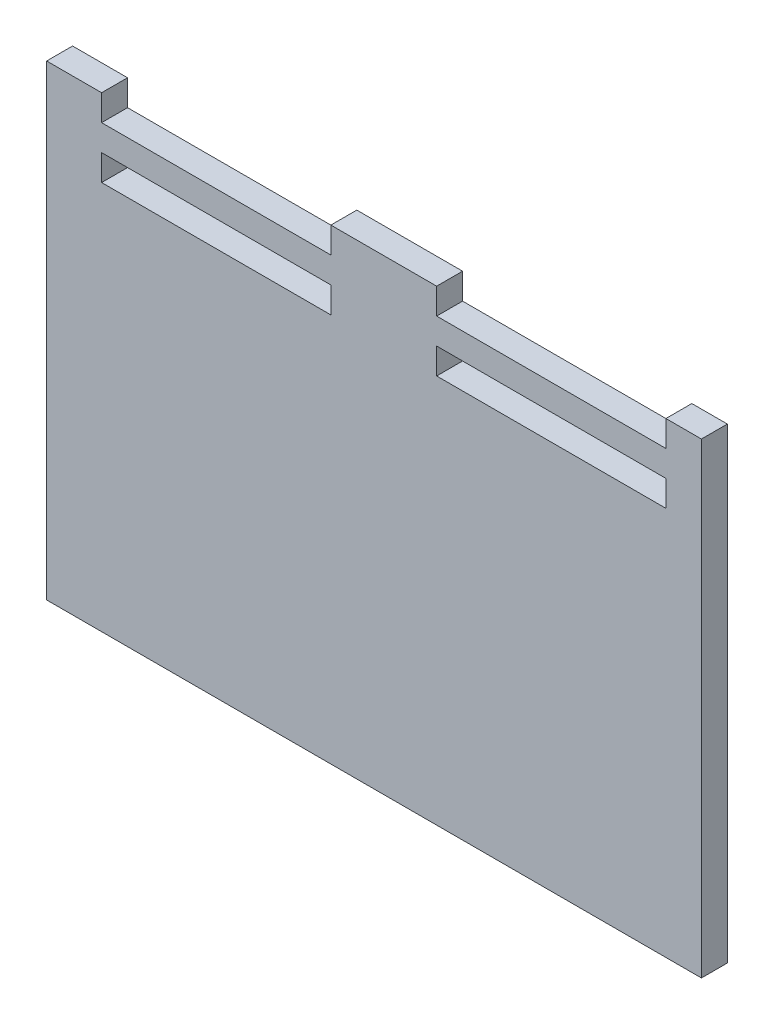
ISO-10303-21;
HEADER;
FILE_DESCRIPTION(('STEP AP214'),'2;1');
FILE_NAME('part.step','',(''),(''),'','','');
FILE_SCHEMA(('AUTOMOTIVE_DESIGN { 1 0 10303 214 1 1 1 1 }'));
ENDSEC;
DATA;
#1=APPLICATION_CONTEXT('core data for automotive mechanical design processes');
#2=APPLICATION_PROTOCOL_DEFINITION('international standard','automotive_design',2000,#1);
#3=PRODUCT_CONTEXT('',#1,'mechanical');
#4=PRODUCT('Part','Part','',(#3));
#5=PRODUCT_RELATED_PRODUCT_CATEGORY('part','',(#4));
#6=PRODUCT_DEFINITION_FORMATION('','',#4);
#7=PRODUCT_DEFINITION_CONTEXT('part definition',#1,'design');
#8=PRODUCT_DEFINITION('design','',#6,#7);
#9=PRODUCT_DEFINITION_SHAPE('','',#8);
#10=(LENGTH_UNIT() NAMED_UNIT(*) SI_UNIT(.MILLI.,.METRE.));
#11=(NAMED_UNIT(*) PLANE_ANGLE_UNIT() SI_UNIT($,.RADIAN.));
#12=(NAMED_UNIT(*) SI_UNIT($,.STERADIAN.) SOLID_ANGLE_UNIT());
#13=UNCERTAINTY_MEASURE_WITH_UNIT(LENGTH_MEASURE(1.E-05),#10,'distance_accuracy_value','');
#14=(GEOMETRIC_REPRESENTATION_CONTEXT(3) GLOBAL_UNCERTAINTY_ASSIGNED_CONTEXT((#13)) GLOBAL_UNIT_ASSIGNED_CONTEXT((#10,
#11,#12)) REPRESENTATION_CONTEXT('',''));
#15=CARTESIAN_POINT('',(0.,0.,0.));
#16=DIRECTION('',(0.,0.,1.));
#17=DIRECTION('',(1.,0.,0.));
#18=AXIS2_PLACEMENT_3D('',#15,#16,#17);
#19=CARTESIAN_POINT('',(0.,228.6,12.7));
#20=DIRECTION('',(0.,-1.,0.));
#21=DIRECTION('',(0.,0.,-1.));
#22=AXIS2_PLACEMENT_3D('',#19,#20,#21);
#23=PLANE('',#22);
#24=DIRECTION('',(0.,0.,1.));
#25=VECTOR('',#24,1.);
#26=CARTESIAN_POINT('',(290.576,228.6,0.));
#27=LINE('',#26,#25);
#28=CARTESIAN_POINT('',(290.576,228.6,0.));
#29=VERTEX_POINT('',#28);
#30=CARTESIAN_POINT('',(290.576,228.6,12.7));
#31=VERTEX_POINT('',#30);
#32=EDGE_CURVE('E258',#29,#31,#27,.T.);
#33=ORIENTED_EDGE('',*,*,#32,.T.);
#34=DIRECTION('',(-1.,0.,0.));
#35=VECTOR('',#34,1.);
#36=CARTESIAN_POINT('',(0.,228.6,12.7));
#37=LINE('',#36,#35);
#38=CARTESIAN_POINT('',(307.975,228.6,12.7));
#39=VERTEX_POINT('',#38);
#40=EDGE_CURVE('E11',#39,#31,#37,.T.);
#41=ORIENTED_EDGE('',*,*,#40,.F.);
#42=DIRECTION('',(0.,0.,1.));
#43=VECTOR('',#42,1.);
#44=CARTESIAN_POINT('',(307.975,228.6,0.));
#45=LINE('',#44,#43);
#46=CARTESIAN_POINT('',(307.975,228.6,0.));
#47=VERTEX_POINT('',#46);
#48=EDGE_CURVE('E199',#47,#39,#45,.T.);
#49=ORIENTED_EDGE('',*,*,#48,.F.);
#50=DIRECTION('',(-1.,0.,0.));
#51=VECTOR('',#50,1.);
#52=CARTESIAN_POINT('',(0.,228.6,0.));
#53=LINE('',#52,#51);
#54=EDGE_CURVE('E44',#47,#29,#53,.T.);
#55=ORIENTED_EDGE('',*,*,#54,.T.);
#56=EDGE_LOOP('',(#33,#41,#49,#55));
#57=FACE_BOUND('',#56,.T.);
#58=ADVANCED_FACE('F40',(#57),#23,.F.);
#59=CARTESIAN_POINT('',(178.308,228.6,12.7));
#60=VERTEX_POINT('',#59);
#61=CARTESIAN_POINT('',(126.492,228.6,12.7));
#62=VERTEX_POINT('',#61);
#63=EDGE_CURVE('E49',#60,#62,#37,.T.);
#64=ORIENTED_EDGE('',*,*,#63,.F.);
#65=DIRECTION('',(0.,0.,1.));
#66=VECTOR('',#65,1.);
#67=CARTESIAN_POINT('',(178.308,228.6,0.));
#68=LINE('',#67,#66);
#69=CARTESIAN_POINT('',(178.308,228.6,0.));
#70=VERTEX_POINT('',#69);
#71=EDGE_CURVE('E260',#70,#60,#68,.T.);
#72=ORIENTED_EDGE('',*,*,#71,.F.);
#73=CARTESIAN_POINT('',(126.492,228.6,0.));
#74=VERTEX_POINT('',#73);
#75=EDGE_CURVE('E196',#70,#74,#53,.T.);
#76=ORIENTED_EDGE('',*,*,#75,.T.);
#77=DIRECTION('',(0.,0.,1.));
#78=VECTOR('',#77,1.);
#79=CARTESIAN_POINT('',(126.492,228.6,0.));
#80=LINE('',#79,#78);
#81=EDGE_CURVE('E314',#74,#62,#80,.T.);
#82=ORIENTED_EDGE('',*,*,#81,.T.);
#83=EDGE_LOOP('',(#64,#72,#76,#82));
#84=FACE_BOUND('',#83,.T.);
#85=ADVANCED_FACE('F342',(#84),#23,.F.);
#86=CARTESIAN_POINT('',(0.,0.,12.7));
#87=DIRECTION('',(0.,0.,-1.));
#88=DIRECTION('',(-1.,0.,0.));
#89=AXIS2_PLACEMENT_3D('',#86,#87,#88);
#90=PLANE('',#89);
#91=DIRECTION('',(1.,0.,0.));
#92=VECTOR('',#91,1.);
#93=CARTESIAN_POINT('',(178.308,215.9,12.7));
#94=LINE('',#93,#92);
#95=CARTESIAN_POINT('',(178.308,215.9,12.7));
#96=VERTEX_POINT('',#95);
#97=CARTESIAN_POINT('',(290.576,215.9,12.7));
#98=VERTEX_POINT('',#97);
#99=EDGE_CURVE('E265',#96,#98,#94,.T.);
#100=ORIENTED_EDGE('',*,*,#99,.F.);
#101=DIRECTION('',(0.,-1.,0.));
#102=VECTOR('',#101,1.);
#103=CARTESIAN_POINT('',(178.308,228.6,12.7));
#104=LINE('',#103,#102);
#105=EDGE_CURVE('E269',#60,#96,#104,.T.);
#106=ORIENTED_EDGE('',*,*,#105,.F.);
#107=ORIENTED_EDGE('',*,*,#63,.T.);
#108=DIRECTION('',(0.,-1.,0.));
#109=VECTOR('',#108,1.);
#110=CARTESIAN_POINT('',(126.492,0.,12.7));
#111=LINE('',#110,#109);
#112=CARTESIAN_POINT('',(126.492,215.9,12.7));
#113=VERTEX_POINT('',#112);
#114=EDGE_CURVE('E272',#62,#113,#111,.T.);
#115=ORIENTED_EDGE('',*,*,#114,.T.);
#116=DIRECTION('',(1.,0.,0.));
#117=VECTOR('',#116,1.);
#118=CARTESIAN_POINT('',(0.,215.9,12.7));
#119=LINE('',#118,#117);
#120=CARTESIAN_POINT('',(14.224,215.9,12.7));
#121=VERTEX_POINT('',#120);
#122=EDGE_CURVE('E308',#121,#113,#119,.T.);
#123=ORIENTED_EDGE('',*,*,#122,.F.);
#124=DIRECTION('',(0.,-1.,0.));
#125=VECTOR('',#124,1.);
#126=CARTESIAN_POINT('',(14.224,0.,12.7));
#127=LINE('',#126,#125);
#128=CARTESIAN_POINT('',(14.224,228.6,12.7));
#129=VERTEX_POINT('',#128);
#130=EDGE_CURVE('E317',#129,#121,#127,.T.);
#131=ORIENTED_EDGE('',*,*,#130,.F.);
#132=CARTESIAN_POINT('',(-12.7,228.6,12.7));
#133=VERTEX_POINT('',#132);
#134=EDGE_CURVE('E51',#129,#133,#37,.T.);
#135=ORIENTED_EDGE('',*,*,#134,.T.);
#136=DIRECTION('',(0.,-1.,0.));
#137=VECTOR('',#136,1.);
#138=CARTESIAN_POINT('',(-12.7,0.,12.7));
#139=LINE('',#138,#137);
#140=CARTESIAN_POINT('',(-12.7,0.,12.7));
#141=VERTEX_POINT('',#140);
#142=EDGE_CURVE('E211',#133,#141,#139,.T.);
#143=ORIENTED_EDGE('',*,*,#142,.T.);
#144=DIRECTION('',(1.,0.,0.));
#145=VECTOR('',#144,1.);
#146=CARTESIAN_POINT('',(0.,0.,12.7));
#147=LINE('',#146,#145);
#148=CARTESIAN_POINT('',(307.975,0.,12.7));
#149=VERTEX_POINT('',#148);
#150=EDGE_CURVE('E195',#141,#149,#147,.T.);
#151=ORIENTED_EDGE('',*,*,#150,.T.);
#152=DIRECTION('',(0.,-1.,0.));
#153=VECTOR('',#152,1.);
#154=CARTESIAN_POINT('',(307.975,0.,12.7));
#155=LINE('',#154,#153);
#156=EDGE_CURVE('E207',#39,#149,#155,.T.);
#157=ORIENTED_EDGE('',*,*,#156,.F.);
#158=ORIENTED_EDGE('',*,*,#40,.T.);
#159=DIRECTION('',(0.,-1.,0.));
#160=VECTOR('',#159,1.);
#161=CARTESIAN_POINT('',(290.576,228.6,12.7));
#162=LINE('',#161,#160);
#163=EDGE_CURVE('E262',#31,#98,#162,.T.);
#164=ORIENTED_EDGE('',*,*,#163,.T.);
#165=EDGE_LOOP('',(#100,#106,#107,#115,#123,#131,#135,#143,#151,#157,#158,#164));
#166=FACE_BOUND('',#165,.T.);
#167=DIRECTION('',(0.,-1.,0.));
#168=VECTOR('',#167,1.);
#169=CARTESIAN_POINT('',(126.492,203.2,12.7));
#170=LINE('',#169,#168);
#171=CARTESIAN_POINT('',(126.492,203.2,12.7));
#172=VERTEX_POINT('',#171);
#173=CARTESIAN_POINT('',(126.492,190.5,12.7));
#174=VERTEX_POINT('',#173);
#175=EDGE_CURVE('E292',#172,#174,#170,.T.);
#176=ORIENTED_EDGE('',*,*,#175,.T.);
#177=DIRECTION('',(1.,0.,0.));
#178=VECTOR('',#177,1.);
#179=CARTESIAN_POINT('',(14.224,190.5,12.7));
#180=LINE('',#179,#178);
#181=CARTESIAN_POINT('',(14.224,190.5,12.7));
#182=VERTEX_POINT('',#181);
#183=EDGE_CURVE('E58',#182,#174,#180,.T.);
#184=ORIENTED_EDGE('',*,*,#183,.F.);
#185=DIRECTION('',(0.,-1.,0.));
#186=VECTOR('',#185,1.);
#187=CARTESIAN_POINT('',(14.224,203.2,12.7));
#188=LINE('',#187,#186);
#189=CARTESIAN_POINT('',(14.224,203.2,12.7));
#190=VERTEX_POINT('',#189);
#191=EDGE_CURVE('E285',#190,#182,#188,.T.);
#192=ORIENTED_EDGE('',*,*,#191,.F.);
#193=DIRECTION('',(1.,0.,0.));
#194=VECTOR('',#193,1.);
#195=CARTESIAN_POINT('',(14.224,203.2,12.7));
#196=LINE('',#195,#194);
#197=EDGE_CURVE('E288',#190,#172,#196,.T.);
#198=ORIENTED_EDGE('',*,*,#197,.T.);
#199=EDGE_LOOP('',(#176,#184,#192,#198));
#200=FACE_BOUND('',#199,.T.);
#201=DIRECTION('',(0.,-1.,0.));
#202=VECTOR('',#201,1.);
#203=CARTESIAN_POINT('',(290.576,203.2,12.7));
#204=LINE('',#203,#202);
#205=CARTESIAN_POINT('',(290.576,203.2,12.7));
#206=VERTEX_POINT('',#205);
#207=CARTESIAN_POINT('',(290.576,190.5,12.7));
#208=VERTEX_POINT('',#207);
#209=EDGE_CURVE('E240',#206,#208,#204,.T.);
#210=ORIENTED_EDGE('',*,*,#209,.T.);
#211=DIRECTION('',(1.,0.,0.));
#212=VECTOR('',#211,1.);
#213=CARTESIAN_POINT('',(178.308,190.5,12.7));
#214=LINE('',#213,#212);
#215=CARTESIAN_POINT('',(178.308,190.5,12.7));
#216=VERTEX_POINT('',#215);
#217=EDGE_CURVE('E66',#216,#208,#214,.T.);
#218=ORIENTED_EDGE('',*,*,#217,.F.);
#219=DIRECTION('',(0.,-1.,0.));
#220=VECTOR('',#219,1.);
#221=CARTESIAN_POINT('',(178.308,203.2,12.7));
#222=LINE('',#221,#220);
#223=CARTESIAN_POINT('',(178.308,203.2,12.7));
#224=VERTEX_POINT('',#223);
#225=EDGE_CURVE('E233',#224,#216,#222,.T.);
#226=ORIENTED_EDGE('',*,*,#225,.F.);
#227=DIRECTION('',(1.,0.,0.));
#228=VECTOR('',#227,1.);
#229=CARTESIAN_POINT('',(178.308,203.2,12.7));
#230=LINE('',#229,#228);
#231=EDGE_CURVE('E236',#224,#206,#230,.T.);
#232=ORIENTED_EDGE('',*,*,#231,.T.);
#233=EDGE_LOOP('',(#210,#218,#226,#232));
#234=FACE_BOUND('',#233,.T.);
#235=ADVANCED_FACE('F355',(#166,#200,#234),#90,.F.);
#236=CARTESIAN_POINT('',(0.,0.,0.));
#237=DIRECTION('',(0.,0.,-1.));
#238=DIRECTION('',(-1.,0.,0.));
#239=AXIS2_PLACEMENT_3D('',#236,#237,#238);
#240=PLANE('',#239);
#241=DIRECTION('',(0.,-1.,0.));
#242=VECTOR('',#241,1.);
#243=CARTESIAN_POINT('',(178.308,228.6,0.));
#244=LINE('',#243,#242);
#245=CARTESIAN_POINT('',(178.308,215.9,0.));
#246=VERTEX_POINT('',#245);
#247=EDGE_CURVE('E266',#70,#246,#244,.T.);
#248=ORIENTED_EDGE('',*,*,#247,.T.);
#249=DIRECTION('',(1.,0.,0.));
#250=VECTOR('',#249,1.);
#251=CARTESIAN_POINT('',(178.308,215.9,0.));
#252=LINE('',#251,#250);
#253=CARTESIAN_POINT('',(290.576,215.9,0.));
#254=VERTEX_POINT('',#253);
#255=EDGE_CURVE('E274',#246,#254,#252,.T.);
#256=ORIENTED_EDGE('',*,*,#255,.T.);
#257=DIRECTION('',(0.,-1.,0.));
#258=VECTOR('',#257,1.);
#259=CARTESIAN_POINT('',(290.576,228.6,0.));
#260=LINE('',#259,#258);
#261=EDGE_CURVE('E192',#29,#254,#260,.T.);
#262=ORIENTED_EDGE('',*,*,#261,.F.);
#263=ORIENTED_EDGE('',*,*,#54,.F.);
#264=DIRECTION('',(0.,-1.,0.));
#265=VECTOR('',#264,1.);
#266=CARTESIAN_POINT('',(307.975,0.,0.));
#267=LINE('',#266,#265);
#268=CARTESIAN_POINT('',(307.975,0.,0.));
#269=VERTEX_POINT('',#268);
#270=EDGE_CURVE('E188',#47,#269,#267,.T.);
#271=ORIENTED_EDGE('',*,*,#270,.T.);
#272=DIRECTION('',(1.,0.,0.));
#273=VECTOR('',#272,1.);
#274=CARTESIAN_POINT('',(0.,0.,0.));
#275=LINE('',#274,#273);
#276=CARTESIAN_POINT('',(-12.7,0.,0.));
#277=VERTEX_POINT('',#276);
#278=EDGE_CURVE('E324',#277,#269,#275,.T.);
#279=ORIENTED_EDGE('',*,*,#278,.F.);
#280=DIRECTION('',(0.,-1.,0.));
#281=VECTOR('',#280,1.);
#282=CARTESIAN_POINT('',(-12.7,0.,0.));
#283=LINE('',#282,#281);
#284=CARTESIAN_POINT('',(-12.7,228.6,0.));
#285=VERTEX_POINT('',#284);
#286=EDGE_CURVE('E213',#285,#277,#283,.T.);
#287=ORIENTED_EDGE('',*,*,#286,.F.);
#288=CARTESIAN_POINT('',(14.224,228.6,0.));
#289=VERTEX_POINT('',#288);
#290=EDGE_CURVE('E197',#289,#285,#53,.T.);
#291=ORIENTED_EDGE('',*,*,#290,.F.);
#292=DIRECTION('',(0.,-1.,0.));
#293=VECTOR('',#292,1.);
#294=CARTESIAN_POINT('',(14.224,0.,0.));
#295=LINE('',#294,#293);
#296=CARTESIAN_POINT('',(14.224,215.9,0.));
#297=VERTEX_POINT('',#296);
#298=EDGE_CURVE('E307',#289,#297,#295,.T.);
#299=ORIENTED_EDGE('',*,*,#298,.T.);
#300=DIRECTION('',(1.,0.,0.));
#301=VECTOR('',#300,1.);
#302=CARTESIAN_POINT('',(0.,215.9,0.));
#303=LINE('',#302,#301);
#304=CARTESIAN_POINT('',(126.492,215.9,0.));
#305=VERTEX_POINT('',#304);
#306=EDGE_CURVE('E311',#297,#305,#303,.T.);
#307=ORIENTED_EDGE('',*,*,#306,.T.);
#308=DIRECTION('',(0.,-1.,0.));
#309=VECTOR('',#308,1.);
#310=CARTESIAN_POINT('',(126.492,0.,0.));
#311=LINE('',#310,#309);
#312=EDGE_CURVE('E305',#74,#305,#311,.T.);
#313=ORIENTED_EDGE('',*,*,#312,.F.);
#314=ORIENTED_EDGE('',*,*,#75,.F.);
#315=EDGE_LOOP('',(#248,#256,#262,#263,#271,#279,#287,#291,#299,#307,#313,#314));
#316=FACE_BOUND('',#315,.T.);
#317=DIRECTION('',(1.,0.,0.));
#318=VECTOR('',#317,1.);
#319=CARTESIAN_POINT('',(14.224,190.5,0.));
#320=LINE('',#319,#318);
#321=CARTESIAN_POINT('',(14.224,190.5,0.));
#322=VERTEX_POINT('',#321);
#323=CARTESIAN_POINT('',(126.492,190.5,0.));
#324=VERTEX_POINT('',#323);
#325=EDGE_CURVE('E289',#322,#324,#320,.T.);
#326=ORIENTED_EDGE('',*,*,#325,.T.);
#327=DIRECTION('',(0.,-1.,0.));
#328=VECTOR('',#327,1.);
#329=CARTESIAN_POINT('',(126.492,203.2,0.));
#330=LINE('',#329,#328);
#331=CARTESIAN_POINT('',(126.492,203.2,0.));
#332=VERTEX_POINT('',#331);
#333=EDGE_CURVE('E301',#332,#324,#330,.T.);
#334=ORIENTED_EDGE('',*,*,#333,.F.);
#335=DIRECTION('',(1.,0.,0.));
#336=VECTOR('',#335,1.);
#337=CARTESIAN_POINT('',(14.224,203.2,0.));
#338=LINE('',#337,#336);
#339=CARTESIAN_POINT('',(14.224,203.2,0.));
#340=VERTEX_POINT('',#339);
#341=EDGE_CURVE('E298',#340,#332,#338,.T.);
#342=ORIENTED_EDGE('',*,*,#341,.F.);
#343=DIRECTION('',(0.,-1.,0.));
#344=VECTOR('',#343,1.);
#345=CARTESIAN_POINT('',(14.224,203.2,0.));
#346=LINE('',#345,#344);
#347=EDGE_CURVE('E279',#340,#322,#346,.T.);
#348=ORIENTED_EDGE('',*,*,#347,.T.);
#349=EDGE_LOOP('',(#326,#334,#342,#348));
#350=FACE_BOUND('',#349,.T.);
#351=DIRECTION('',(1.,0.,0.));
#352=VECTOR('',#351,1.);
#353=CARTESIAN_POINT('',(178.308,190.5,0.));
#354=LINE('',#353,#352);
#355=CARTESIAN_POINT('',(178.308,190.5,0.));
#356=VERTEX_POINT('',#355);
#357=CARTESIAN_POINT('',(290.576,190.5,0.));
#358=VERTEX_POINT('',#357);
#359=EDGE_CURVE('E237',#356,#358,#354,.T.);
#360=ORIENTED_EDGE('',*,*,#359,.T.);
#361=DIRECTION('',(0.,-1.,0.));
#362=VECTOR('',#361,1.);
#363=CARTESIAN_POINT('',(290.576,203.2,0.));
#364=LINE('',#363,#362);
#365=CARTESIAN_POINT('',(290.576,203.2,0.));
#366=VERTEX_POINT('',#365);
#367=EDGE_CURVE('E250',#366,#358,#364,.T.);
#368=ORIENTED_EDGE('',*,*,#367,.F.);
#369=DIRECTION('',(1.,0.,0.));
#370=VECTOR('',#369,1.);
#371=CARTESIAN_POINT('',(178.308,203.2,0.));
#372=LINE('',#371,#370);
#373=CARTESIAN_POINT('',(178.308,203.2,0.));
#374=VERTEX_POINT('',#373);
#375=EDGE_CURVE('E247',#374,#366,#372,.T.);
#376=ORIENTED_EDGE('',*,*,#375,.F.);
#377=DIRECTION('',(0.,-1.,0.));
#378=VECTOR('',#377,1.);
#379=CARTESIAN_POINT('',(178.308,203.2,0.));
#380=LINE('',#379,#378);
#381=EDGE_CURVE('E227',#374,#356,#380,.T.);
#382=ORIENTED_EDGE('',*,*,#381,.T.);
#383=EDGE_LOOP('',(#360,#368,#376,#382));
#384=FACE_BOUND('',#383,.T.);
#385=ADVANCED_FACE('F185',(#316,#350,#384),#240,.T.);
#386=CARTESIAN_POINT('',(0.,0.,12.7));
#387=DIRECTION('',(0.,1.,0.));
#388=DIRECTION('',(0.,0.,1.));
#389=AXIS2_PLACEMENT_3D('',#386,#387,#388);
#390=PLANE('',#389);
#391=ORIENTED_EDGE('',*,*,#278,.T.);
#392=DIRECTION('',(0.,0.,1.));
#393=VECTOR('',#392,1.);
#394=CARTESIAN_POINT('',(307.975,0.,0.));
#395=LINE('',#394,#393);
#396=EDGE_CURVE('E203',#269,#149,#395,.T.);
#397=ORIENTED_EDGE('',*,*,#396,.T.);
#398=ORIENTED_EDGE('',*,*,#150,.F.);
#399=DIRECTION('',(0.,0.,1.));
#400=VECTOR('',#399,1.);
#401=CARTESIAN_POINT('',(-12.7,0.,0.));
#402=LINE('',#401,#400);
#403=EDGE_CURVE('E219',#277,#141,#402,.T.);
#404=ORIENTED_EDGE('',*,*,#403,.F.);
#405=EDGE_LOOP('',(#391,#397,#398,#404));
#406=FACE_BOUND('',#405,.T.);
#407=ADVANCED_FACE('F42',(#406),#390,.F.);
#408=ORIENTED_EDGE('',*,*,#134,.F.);
#409=DIRECTION('',(0.,0.,1.));
#410=VECTOR('',#409,1.);
#411=CARTESIAN_POINT('',(14.224,228.6,0.));
#412=LINE('',#411,#410);
#413=EDGE_CURVE('E327',#289,#129,#412,.T.);
#414=ORIENTED_EDGE('',*,*,#413,.F.);
#415=ORIENTED_EDGE('',*,*,#290,.T.);
#416=DIRECTION('',(0.,0.,1.));
#417=VECTOR('',#416,1.);
#418=CARTESIAN_POINT('',(-12.7,228.6,0.));
#419=LINE('',#418,#417);
#420=EDGE_CURVE('E216',#285,#133,#419,.T.);
#421=ORIENTED_EDGE('',*,*,#420,.T.);
#422=EDGE_LOOP('',(#408,#414,#415,#421));
#423=FACE_BOUND('',#422,.T.);
#424=ADVANCED_FACE('F360',(#423),#23,.F.);
#425=CARTESIAN_POINT('',(126.492,0.,0.));
#426=DIRECTION('',(-1.,0.,0.));
#427=DIRECTION('',(0.,0.,1.));
#428=AXIS2_PLACEMENT_3D('',#425,#426,#427);
#429=PLANE('',#428);
#430=ORIENTED_EDGE('',*,*,#114,.F.);
#431=ORIENTED_EDGE('',*,*,#81,.F.);
#432=ORIENTED_EDGE('',*,*,#312,.T.);
#433=DIRECTION('',(0.,0.,1.));
#434=VECTOR('',#433,1.);
#435=CARTESIAN_POINT('',(126.492,215.9,0.));
#436=LINE('',#435,#434);
#437=EDGE_CURVE('E322',#305,#113,#436,.T.);
#438=ORIENTED_EDGE('',*,*,#437,.T.);
#439=EDGE_LOOP('',(#430,#431,#432,#438));
#440=FACE_BOUND('',#439,.T.);
#441=ADVANCED_FACE('F347',(#440),#429,.T.);
#442=CARTESIAN_POINT('',(0.,215.9,0.));
#443=DIRECTION('',(0.,-1.,0.));
#444=DIRECTION('',(0.,0.,-1.));
#445=AXIS2_PLACEMENT_3D('',#442,#443,#444);
#446=PLANE('',#445);
#447=ORIENTED_EDGE('',*,*,#122,.T.);
#448=ORIENTED_EDGE('',*,*,#437,.F.);
#449=ORIENTED_EDGE('',*,*,#306,.F.);
#450=DIRECTION('',(0.,0.,1.));
#451=VECTOR('',#450,1.);
#452=CARTESIAN_POINT('',(14.224,215.9,0.));
#453=LINE('',#452,#451);
#454=EDGE_CURVE('E325',#297,#121,#453,.T.);
#455=ORIENTED_EDGE('',*,*,#454,.T.);
#456=EDGE_LOOP('',(#447,#448,#449,#455));
#457=FACE_BOUND('',#456,.T.);
#458=ADVANCED_FACE('F349',(#457),#446,.F.);
#459=CARTESIAN_POINT('',(14.224,0.,0.));
#460=DIRECTION('',(-1.,0.,0.));
#461=DIRECTION('',(0.,0.,1.));
#462=AXIS2_PLACEMENT_3D('',#459,#460,#461);
#463=PLANE('',#462);
#464=ORIENTED_EDGE('',*,*,#130,.T.);
#465=ORIENTED_EDGE('',*,*,#454,.F.);
#466=ORIENTED_EDGE('',*,*,#298,.F.);
#467=ORIENTED_EDGE('',*,*,#413,.T.);
#468=EDGE_LOOP('',(#464,#465,#466,#467));
#469=FACE_BOUND('',#468,.T.);
#470=ADVANCED_FACE('F403',(#469),#463,.F.);
#471=CARTESIAN_POINT('',(178.308,190.5,0.));
#472=DIRECTION('',(0.,-1.,0.));
#473=DIRECTION('',(1.,0.,0.));
#474=AXIS2_PLACEMENT_3D('',#471,#472,#473);
#475=PLANE('',#474);
#476=ORIENTED_EDGE('',*,*,#217,.T.);
#477=DIRECTION('',(0.,0.,1.));
#478=VECTOR('',#477,1.);
#479=CARTESIAN_POINT('',(290.576,190.5,0.));
#480=LINE('',#479,#478);
#481=EDGE_CURVE('E225',#358,#208,#480,.T.);
#482=ORIENTED_EDGE('',*,*,#481,.F.);
#483=ORIENTED_EDGE('',*,*,#359,.F.);
#484=DIRECTION('',(0.,0.,1.));
#485=VECTOR('',#484,1.);
#486=CARTESIAN_POINT('',(178.308,190.5,0.));
#487=LINE('',#486,#485);
#488=EDGE_CURVE('E222',#356,#216,#487,.T.);
#489=ORIENTED_EDGE('',*,*,#488,.T.);
#490=EDGE_LOOP('',(#476,#482,#483,#489));
#491=FACE_BOUND('',#490,.T.);
#492=ADVANCED_FACE('F406',(#491),#475,.F.);
#493=CARTESIAN_POINT('',(178.308,203.2,0.));
#494=DIRECTION('',(-1.,0.,0.));
#495=DIRECTION('',(0.,0.,1.));
#496=AXIS2_PLACEMENT_3D('',#493,#494,#495);
#497=PLANE('',#496);
#498=ORIENTED_EDGE('',*,*,#225,.T.);
#499=ORIENTED_EDGE('',*,*,#488,.F.);
#500=ORIENTED_EDGE('',*,*,#381,.F.);
#501=DIRECTION('',(0.,0.,1.));
#502=VECTOR('',#501,1.);
#503=CARTESIAN_POINT('',(178.308,203.2,0.));
#504=LINE('',#503,#502);
#505=EDGE_CURVE('E230',#374,#224,#504,.T.);
#506=ORIENTED_EDGE('',*,*,#505,.T.);
#507=EDGE_LOOP('',(#498,#499,#500,#506));
#508=FACE_BOUND('',#507,.T.);
#509=ADVANCED_FACE('F432',(#508),#497,.F.);
#510=CARTESIAN_POINT('',(178.308,203.2,0.));
#511=DIRECTION('',(0.,-1.,0.));
#512=DIRECTION('',(0.,0.,-1.));
#513=AXIS2_PLACEMENT_3D('',#510,#511,#512);
#514=PLANE('',#513);
#515=ORIENTED_EDGE('',*,*,#231,.F.);
#516=ORIENTED_EDGE('',*,*,#505,.F.);
#517=ORIENTED_EDGE('',*,*,#375,.T.);
#518=DIRECTION('',(0.,0.,1.));
#519=VECTOR('',#518,1.);
#520=CARTESIAN_POINT('',(290.576,203.2,0.));
#521=LINE('',#520,#519);
#522=EDGE_CURVE('E228',#366,#206,#521,.T.);
#523=ORIENTED_EDGE('',*,*,#522,.T.);
#524=EDGE_LOOP('',(#515,#516,#517,#523));
#525=FACE_BOUND('',#524,.T.);
#526=ADVANCED_FACE('F435',(#525),#514,.T.);
#527=CARTESIAN_POINT('',(290.576,203.2,0.));
#528=DIRECTION('',(-1.,0.,0.));
#529=DIRECTION('',(0.,-1.,0.));
#530=AXIS2_PLACEMENT_3D('',#527,#528,#529);
#531=PLANE('',#530);
#532=ORIENTED_EDGE('',*,*,#209,.F.);
#533=ORIENTED_EDGE('',*,*,#522,.F.);
#534=ORIENTED_EDGE('',*,*,#367,.T.);
#535=ORIENTED_EDGE('',*,*,#481,.T.);
#536=EDGE_LOOP('',(#532,#533,#534,#535));
#537=FACE_BOUND('',#536,.T.);
#538=ADVANCED_FACE('F419',(#537),#531,.T.);
#539=CARTESIAN_POINT('',(14.224,190.5,0.));
#540=DIRECTION('',(0.,-1.,0.));
#541=DIRECTION('',(1.,0.,0.));
#542=AXIS2_PLACEMENT_3D('',#539,#540,#541);
#543=PLANE('',#542);
#544=ORIENTED_EDGE('',*,*,#183,.T.);
#545=DIRECTION('',(0.,0.,1.));
#546=VECTOR('',#545,1.);
#547=CARTESIAN_POINT('',(126.492,190.5,0.));
#548=LINE('',#547,#546);
#549=EDGE_CURVE('E277',#324,#174,#548,.T.);
#550=ORIENTED_EDGE('',*,*,#549,.F.);
#551=ORIENTED_EDGE('',*,*,#325,.F.);
#552=DIRECTION('',(0.,0.,1.));
#553=VECTOR('',#552,1.);
#554=CARTESIAN_POINT('',(14.224,190.5,0.));
#555=LINE('',#554,#553);
#556=EDGE_CURVE('E244',#322,#182,#555,.T.);
#557=ORIENTED_EDGE('',*,*,#556,.T.);
#558=EDGE_LOOP('',(#544,#550,#551,#557));
#559=FACE_BOUND('',#558,.T.);
#560=ADVANCED_FACE('F413',(#559),#543,.F.);
#561=CARTESIAN_POINT('',(14.224,203.2,0.));
#562=DIRECTION('',(-1.,0.,0.));
#563=DIRECTION('',(0.,-1.,0.));
#564=AXIS2_PLACEMENT_3D('',#561,#562,#563);
#565=PLANE('',#564);
#566=ORIENTED_EDGE('',*,*,#191,.T.);
#567=ORIENTED_EDGE('',*,*,#556,.F.);
#568=ORIENTED_EDGE('',*,*,#347,.F.);
#569=DIRECTION('',(0.,0.,1.));
#570=VECTOR('',#569,1.);
#571=CARTESIAN_POINT('',(14.224,203.2,0.));
#572=LINE('',#571,#570);
#573=EDGE_CURVE('E282',#340,#190,#572,.T.);
#574=ORIENTED_EDGE('',*,*,#573,.T.);
#575=EDGE_LOOP('',(#566,#567,#568,#574));
#576=FACE_BOUND('',#575,.T.);
#577=ADVANCED_FACE('F410',(#576),#565,.F.);
#578=CARTESIAN_POINT('',(14.224,203.2,0.));
#579=DIRECTION('',(0.,-1.,0.));
#580=DIRECTION('',(1.,0.,0.));
#581=AXIS2_PLACEMENT_3D('',#578,#579,#580);
#582=PLANE('',#581);
#583=ORIENTED_EDGE('',*,*,#197,.F.);
#584=ORIENTED_EDGE('',*,*,#573,.F.);
#585=ORIENTED_EDGE('',*,*,#341,.T.);
#586=DIRECTION('',(0.,0.,1.));
#587=VECTOR('',#586,1.);
#588=CARTESIAN_POINT('',(126.492,203.2,0.));
#589=LINE('',#588,#587);
#590=EDGE_CURVE('E280',#332,#172,#589,.T.);
#591=ORIENTED_EDGE('',*,*,#590,.T.);
#592=EDGE_LOOP('',(#583,#584,#585,#591));
#593=FACE_BOUND('',#592,.T.);
#594=ADVANCED_FACE('F379',(#593),#582,.T.);
#595=CARTESIAN_POINT('',(126.492,203.2,0.));
#596=DIRECTION('',(-1.,0.,0.));
#597=DIRECTION('',(0.,0.,1.));
#598=AXIS2_PLACEMENT_3D('',#595,#596,#597);
#599=PLANE('',#598);
#600=ORIENTED_EDGE('',*,*,#175,.F.);
#601=ORIENTED_EDGE('',*,*,#590,.F.);
#602=ORIENTED_EDGE('',*,*,#333,.T.);
#603=ORIENTED_EDGE('',*,*,#549,.T.);
#604=EDGE_LOOP('',(#600,#601,#602,#603));
#605=FACE_BOUND('',#604,.T.);
#606=ADVANCED_FACE('F372',(#605),#599,.T.);
#607=CARTESIAN_POINT('',(178.308,228.6,0.));
#608=DIRECTION('',(-1.,0.,0.));
#609=DIRECTION('',(0.,0.,1.));
#610=AXIS2_PLACEMENT_3D('',#607,#608,#609);
#611=PLANE('',#610);
#612=ORIENTED_EDGE('',*,*,#105,.T.);
#613=DIRECTION('',(0.,0.,1.));
#614=VECTOR('',#613,1.);
#615=CARTESIAN_POINT('',(178.308,215.9,0.));
#616=LINE('',#615,#614);
#617=EDGE_CURVE('E254',#246,#96,#616,.T.);
#618=ORIENTED_EDGE('',*,*,#617,.F.);
#619=ORIENTED_EDGE('',*,*,#247,.F.);
#620=ORIENTED_EDGE('',*,*,#71,.T.);
#621=EDGE_LOOP('',(#612,#618,#619,#620));
#622=FACE_BOUND('',#621,.T.);
#623=ADVANCED_FACE('F370',(#622),#611,.F.);
#624=CARTESIAN_POINT('',(290.576,228.6,0.));
#625=DIRECTION('',(-1.,0.,0.));
#626=DIRECTION('',(0.,0.,1.));
#627=AXIS2_PLACEMENT_3D('',#624,#625,#626);
#628=PLANE('',#627);
#629=ORIENTED_EDGE('',*,*,#163,.F.);
#630=ORIENTED_EDGE('',*,*,#32,.F.);
#631=ORIENTED_EDGE('',*,*,#261,.T.);
#632=DIRECTION('',(0.,0.,1.));
#633=VECTOR('',#632,1.);
#634=CARTESIAN_POINT('',(290.576,215.9,0.));
#635=LINE('',#634,#633);
#636=EDGE_CURVE('E256',#254,#98,#635,.T.);
#637=ORIENTED_EDGE('',*,*,#636,.T.);
#638=EDGE_LOOP('',(#629,#630,#631,#637));
#639=FACE_BOUND('',#638,.T.);
#640=ADVANCED_FACE('F365',(#639),#628,.T.);
#641=CARTESIAN_POINT('',(178.308,215.9,0.));
#642=DIRECTION('',(0.,-1.,0.));
#643=DIRECTION('',(1.,0.,0.));
#644=AXIS2_PLACEMENT_3D('',#641,#642,#643);
#645=PLANE('',#644);
#646=ORIENTED_EDGE('',*,*,#99,.T.);
#647=ORIENTED_EDGE('',*,*,#636,.F.);
#648=ORIENTED_EDGE('',*,*,#255,.F.);
#649=ORIENTED_EDGE('',*,*,#617,.T.);
#650=EDGE_LOOP('',(#646,#647,#648,#649));
#651=FACE_BOUND('',#650,.T.);
#652=ADVANCED_FACE('F368',(#651),#645,.F.);
#653=CARTESIAN_POINT('',(-12.7,0.,0.));
#654=DIRECTION('',(-1.,0.,0.));
#655=DIRECTION('',(0.,-1.,0.));
#656=AXIS2_PLACEMENT_3D('',#653,#654,#655);
#657=PLANE('',#656);
#658=ORIENTED_EDGE('',*,*,#142,.F.);
#659=ORIENTED_EDGE('',*,*,#420,.F.);
#660=ORIENTED_EDGE('',*,*,#286,.T.);
#661=ORIENTED_EDGE('',*,*,#403,.T.);
#662=EDGE_LOOP('',(#658,#659,#660,#661));
#663=FACE_BOUND('',#662,.T.);
#664=ADVANCED_FACE('F363',(#663),#657,.T.);
#665=CARTESIAN_POINT('',(307.975,0.,0.));
#666=DIRECTION('',(-1.,0.,0.));
#667=DIRECTION('',(0.,-1.,0.));
#668=AXIS2_PLACEMENT_3D('',#665,#666,#667);
#669=PLANE('',#668);
#670=ORIENTED_EDGE('',*,*,#156,.T.);
#671=ORIENTED_EDGE('',*,*,#396,.F.);
#672=ORIENTED_EDGE('',*,*,#270,.F.);
#673=ORIENTED_EDGE('',*,*,#48,.T.);
#674=EDGE_LOOP('',(#670,#671,#672,#673));
#675=FACE_BOUND('',#674,.T.);
#676=ADVANCED_FACE('F205',(#675),#669,.F.);
#677=CLOSED_SHELL('',(#58,#85,#235,#385,#407,#424,#441,#458,#470,#492,#509,#526,#538,#560,#577,
#594,#606,#623,#640,#652,#664,#676));
#678=MANIFOLD_SOLID_BREP('B2',#677);
#679=ADVANCED_BREP_SHAPE_REPRESENTATION('',(#18,#678),#14);
#680=SHAPE_DEFINITION_REPRESENTATION(#9,#679);
ENDSEC;
END-ISO-10303-21;
